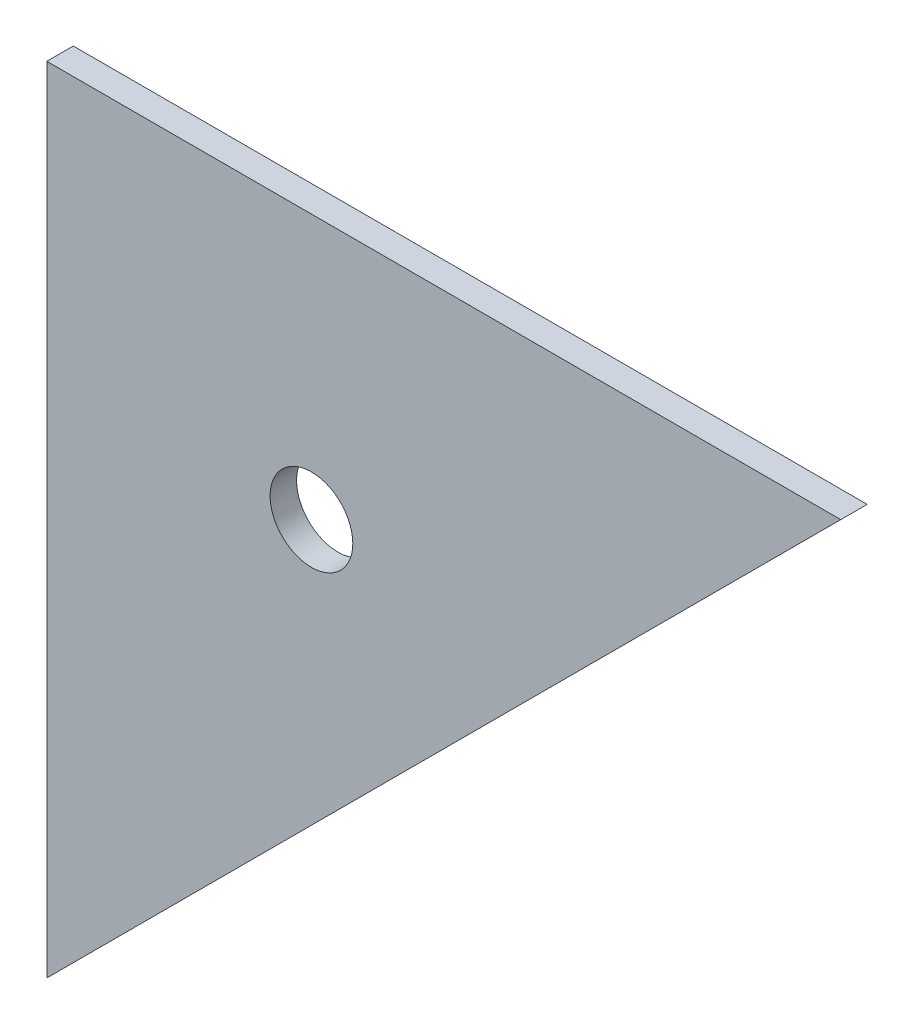
ISO-10303-21;
HEADER;
FILE_DESCRIPTION(('STEP AP214'),'2;1');
FILE_NAME('part.step','',(''),(''),'','','');
FILE_SCHEMA(('AUTOMOTIVE_DESIGN { 1 0 10303 214 1 1 1 1 }'));
ENDSEC;
DATA;
#1=APPLICATION_CONTEXT('core data for automotive mechanical design processes');
#2=APPLICATION_PROTOCOL_DEFINITION('international standard','automotive_design',2000,#1);
#3=PRODUCT_CONTEXT('',#1,'mechanical');
#4=PRODUCT('Part','Part','',(#3));
#5=PRODUCT_RELATED_PRODUCT_CATEGORY('part','',(#4));
#6=PRODUCT_DEFINITION_FORMATION('','',#4);
#7=PRODUCT_DEFINITION_CONTEXT('part definition',#1,'design');
#8=PRODUCT_DEFINITION('design','',#6,#7);
#9=PRODUCT_DEFINITION_SHAPE('','',#8);
#10=(LENGTH_UNIT() NAMED_UNIT(*) SI_UNIT(.MILLI.,.METRE.));
#11=(NAMED_UNIT(*) PLANE_ANGLE_UNIT() SI_UNIT($,.RADIAN.));
#12=(NAMED_UNIT(*) SI_UNIT($,.STERADIAN.) SOLID_ANGLE_UNIT());
#13=UNCERTAINTY_MEASURE_WITH_UNIT(LENGTH_MEASURE(1.E-05),#10,'distance_accuracy_value','');
#14=(GEOMETRIC_REPRESENTATION_CONTEXT(3) GLOBAL_UNCERTAINTY_ASSIGNED_CONTEXT((#13)) GLOBAL_UNIT_ASSIGNED_CONTEXT((#10,
#11,#12)) REPRESENTATION_CONTEXT('',''));
#15=CARTESIAN_POINT('',(0.,0.,0.));
#16=DIRECTION('',(0.,0.,1.));
#17=DIRECTION('',(1.,0.,0.));
#18=AXIS2_PLACEMENT_3D('',#15,#16,#17);
#19=CARTESIAN_POINT('',(-5.26675508351512,-47.1504923478138,2.54));
#20=DIRECTION('',(1.,0.,0.));
#21=DIRECTION('',(0.,0.,-1.));
#22=AXIS2_PLACEMENT_3D('',#19,#20,#21);
#23=PLANE('',#22);
#24=DIRECTION('',(0.,-1.,0.));
#25=VECTOR('',#24,1.);
#26=CARTESIAN_POINT('',(-5.26675508351512,-47.1504923478138,0.));
#27=LINE('',#26,#25);
#28=CARTESIAN_POINT('',(-5.26675508351512,29.0495076521862,0.));
#29=VERTEX_POINT('',#28);
#30=CARTESIAN_POINT('',(-5.26675508351512,-47.1504923478138,0.));
#31=VERTEX_POINT('',#30);
#32=EDGE_CURVE('E83',#29,#31,#27,.T.);
#33=ORIENTED_EDGE('',*,*,#32,.T.);
#34=DIRECTION('',(0.,0.,-1.));
#35=VECTOR('',#34,1.);
#36=CARTESIAN_POINT('',(-5.26675508351512,-47.1504923478138,2.54));
#37=LINE('',#36,#35);
#38=CARTESIAN_POINT('',(-5.26675508351512,-47.1504923478138,2.54));
#39=VERTEX_POINT('',#38);
#40=EDGE_CURVE('E11',#39,#31,#37,.T.);
#41=ORIENTED_EDGE('',*,*,#40,.F.);
#42=DIRECTION('',(0.,-1.,0.));
#43=VECTOR('',#42,1.);
#44=CARTESIAN_POINT('',(-5.26675508351512,-47.1504923478138,2.54));
#45=LINE('',#44,#43);
#46=CARTESIAN_POINT('',(-5.26675508351512,29.0495076521862,2.54));
#47=VERTEX_POINT('',#46);
#48=EDGE_CURVE('E76',#47,#39,#45,.T.);
#49=ORIENTED_EDGE('',*,*,#48,.F.);
#50=DIRECTION('',(0.,0.,-1.));
#51=VECTOR('',#50,1.);
#52=CARTESIAN_POINT('',(-5.26675508351512,29.0495076521862,2.54));
#53=LINE('',#52,#51);
#54=EDGE_CURVE('E84',#47,#29,#53,.T.);
#55=ORIENTED_EDGE('',*,*,#54,.T.);
#56=EDGE_LOOP('',(#33,#41,#49,#55));
#57=FACE_BOUND('',#56,.T.);
#58=ADVANCED_FACE('F35',(#57),#23,.F.);
#59=CARTESIAN_POINT('',(70.9332449164849,29.0495076521862,2.54));
#60=DIRECTION('',(-0.707106781186548,0.707106781186548,0.));
#61=DIRECTION('',(-0.707106781186548,-0.707106781186548,0.));
#62=AXIS2_PLACEMENT_3D('',#59,#60,#61);
#63=PLANE('',#62);
#64=DIRECTION('',(0.707106781186547,0.707106781186547,0.));
#65=VECTOR('',#64,1.);
#66=CARTESIAN_POINT('',(70.9332449164849,29.0495076521862,0.));
#67=LINE('',#66,#65);
#68=CARTESIAN_POINT('',(70.9332449164849,29.0495076521862,0.));
#69=VERTEX_POINT('',#68);
#70=EDGE_CURVE('E64',#31,#69,#67,.T.);
#71=ORIENTED_EDGE('',*,*,#70,.T.);
#72=DIRECTION('',(0.,0.,-1.));
#73=VECTOR('',#72,1.);
#74=CARTESIAN_POINT('',(70.9332449164849,29.0495076521862,2.54));
#75=LINE('',#74,#73);
#76=CARTESIAN_POINT('',(70.9332449164849,29.0495076521862,2.54));
#77=VERTEX_POINT('',#76);
#78=EDGE_CURVE('E44',#77,#69,#75,.T.);
#79=ORIENTED_EDGE('',*,*,#78,.F.);
#80=DIRECTION('',(0.707106781186547,0.707106781186547,0.));
#81=VECTOR('',#80,1.);
#82=CARTESIAN_POINT('',(70.9332449164849,29.0495076521862,2.54));
#83=LINE('',#82,#81);
#84=EDGE_CURVE('E72',#39,#77,#83,.T.);
#85=ORIENTED_EDGE('',*,*,#84,.F.);
#86=ORIENTED_EDGE('',*,*,#40,.T.);
#87=EDGE_LOOP('',(#71,#79,#85,#86));
#88=FACE_BOUND('',#87,.T.);
#89=ADVANCED_FACE('F73',(#88),#63,.F.);
#90=CARTESIAN_POINT('',(-5.26675508351512,29.0495076521862,2.54));
#91=DIRECTION('',(0.,-1.,0.));
#92=DIRECTION('',(0.,0.,-1.));
#93=AXIS2_PLACEMENT_3D('',#90,#91,#92);
#94=PLANE('',#93);
#95=DIRECTION('',(-1.,0.,0.));
#96=VECTOR('',#95,1.);
#97=CARTESIAN_POINT('',(-5.26675508351512,29.0495076521862,0.));
#98=LINE('',#97,#96);
#99=EDGE_CURVE('E69',#69,#29,#98,.T.);
#100=ORIENTED_EDGE('',*,*,#99,.T.);
#101=ORIENTED_EDGE('',*,*,#54,.F.);
#102=DIRECTION('',(-1.,0.,0.));
#103=VECTOR('',#102,1.);
#104=CARTESIAN_POINT('',(-5.26675508351512,29.0495076521862,2.54));
#105=LINE('',#104,#103);
#106=EDGE_CURVE('E52',#77,#47,#105,.T.);
#107=ORIENTED_EDGE('',*,*,#106,.F.);
#108=ORIENTED_EDGE('',*,*,#78,.T.);
#109=EDGE_LOOP('',(#100,#101,#107,#108));
#110=FACE_BOUND('',#109,.T.);
#111=ADVANCED_FACE('F94',(#110),#94,.F.);
#112=CARTESIAN_POINT('',(0.,0.,2.54));
#113=DIRECTION('',(0.,0.,-1.));
#114=DIRECTION('',(-1.,0.,0.));
#115=AXIS2_PLACEMENT_3D('',#112,#113,#114);
#116=PLANE('',#115);
#117=CARTESIAN_POINT('',(20.1332449164849,3.6495076521862,2.54));
#118=DIRECTION('',(0.,0.,1.));
#119=DIRECTION('',(1.,0.,0.));
#120=AXIS2_PLACEMENT_3D('',#117,#118,#119);
#121=CIRCLE('',#120,3.96875);
#122=CARTESIAN_POINT('',(24.1019949164849,3.6495076521862,2.54));
#123=VERTEX_POINT('',#122);
#124=EDGE_CURVE('E89',#123,#123,#121,.T.);
#125=ORIENTED_EDGE('',*,*,#124,.F.);
#126=EDGE_LOOP('',(#125));
#127=FACE_BOUND('',#126,.T.);
#128=ORIENTED_EDGE('',*,*,#48,.T.);
#129=ORIENTED_EDGE('',*,*,#84,.T.);
#130=ORIENTED_EDGE('',*,*,#106,.T.);
#131=EDGE_LOOP('',(#128,#129,#130));
#132=FACE_BOUND('',#131,.T.);
#133=ADVANCED_FACE('F79',(#127,#132),#116,.F.);
#134=CARTESIAN_POINT('',(0.,0.,0.));
#135=DIRECTION('',(0.,0.,-1.));
#136=DIRECTION('',(-1.,0.,0.));
#137=AXIS2_PLACEMENT_3D('',#134,#135,#136);
#138=PLANE('',#137);
#139=CARTESIAN_POINT('',(20.1332449164849,3.6495076521862,0.));
#140=DIRECTION('',(0.,0.,-1.));
#141=DIRECTION('',(-1.,0.,0.));
#142=AXIS2_PLACEMENT_3D('',#139,#140,#141);
#143=CIRCLE('',#142,3.96875);
#144=CARTESIAN_POINT('',(16.1644949164849,3.6495076521862,0.));
#145=VERTEX_POINT('',#144);
#146=EDGE_CURVE('E38',#145,#145,#143,.T.);
#147=ORIENTED_EDGE('',*,*,#146,.F.);
#148=EDGE_LOOP('',(#147));
#149=FACE_BOUND('',#148,.T.);
#150=ORIENTED_EDGE('',*,*,#32,.F.);
#151=ORIENTED_EDGE('',*,*,#99,.F.);
#152=ORIENTED_EDGE('',*,*,#70,.F.);
#153=EDGE_LOOP('',(#150,#151,#152));
#154=FACE_BOUND('',#153,.T.);
#155=ADVANCED_FACE('F95',(#149,#154),#138,.T.);
#156=CARTESIAN_POINT('',(20.1332449164849,3.6495076521862,-99.06));
#157=DIRECTION('',(0.,0.,1.));
#158=DIRECTION('',(1.,0.,0.));
#159=AXIS2_PLACEMENT_3D('',#156,#157,#158);
#160=CYLINDRICAL_SURFACE('',#159,3.96875);
#161=ORIENTED_EDGE('',*,*,#146,.T.);
#162=EDGE_LOOP('',(#161));
#163=FACE_BOUND('',#162,.T.);
#164=ORIENTED_EDGE('',*,*,#124,.T.);
#165=EDGE_LOOP('',(#164));
#166=FACE_BOUND('',#165,.T.);
#167=ADVANCED_FACE('F97',(#163,#166),#160,.F.);
#168=CLOSED_SHELL('',(#58,#89,#111,#133,#155,#167));
#169=MANIFOLD_SOLID_BREP('B2',#168);
#170=ADVANCED_BREP_SHAPE_REPRESENTATION('',(#18,#169),#14);
#171=SHAPE_DEFINITION_REPRESENTATION(#9,#170);
ENDSEC;
END-ISO-10303-21;
